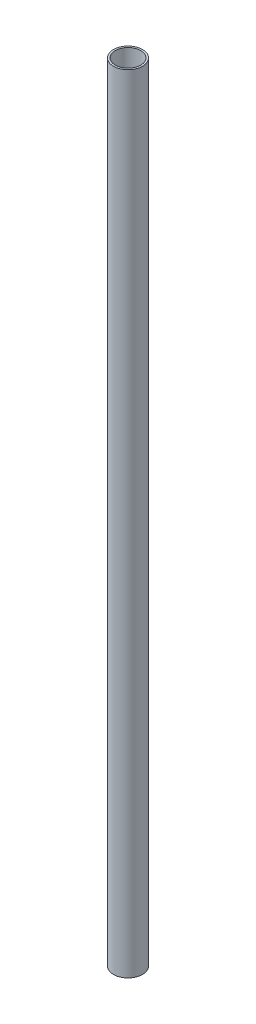
ISO-10303-21;
HEADER;
FILE_DESCRIPTION(('STEP AP214'),'2;1');
FILE_NAME('part.step','',(''),(''),'','','');
FILE_SCHEMA(('AUTOMOTIVE_DESIGN { 1 0 10303 214 1 1 1 1 }'));
ENDSEC;
DATA;
#1=APPLICATION_CONTEXT('core data for automotive mechanical design processes');
#2=APPLICATION_PROTOCOL_DEFINITION('international standard','automotive_design',2000,#1);
#3=PRODUCT_CONTEXT('',#1,'mechanical');
#4=PRODUCT('Part','Part','',(#3));
#5=PRODUCT_RELATED_PRODUCT_CATEGORY('part','',(#4));
#6=PRODUCT_DEFINITION_FORMATION('','',#4);
#7=PRODUCT_DEFINITION_CONTEXT('part definition',#1,'design');
#8=PRODUCT_DEFINITION('design','',#6,#7);
#9=PRODUCT_DEFINITION_SHAPE('','',#8);
#10=(LENGTH_UNIT() NAMED_UNIT(*) SI_UNIT(.MILLI.,.METRE.));
#11=(NAMED_UNIT(*) PLANE_ANGLE_UNIT() SI_UNIT($,.RADIAN.));
#12=(NAMED_UNIT(*) SI_UNIT($,.STERADIAN.) SOLID_ANGLE_UNIT());
#13=UNCERTAINTY_MEASURE_WITH_UNIT(LENGTH_MEASURE(1.E-05),#10,'distance_accuracy_value','');
#14=(GEOMETRIC_REPRESENTATION_CONTEXT(3) GLOBAL_UNCERTAINTY_ASSIGNED_CONTEXT((#13)) GLOBAL_UNIT_ASSIGNED_CONTEXT((#10,
#11,#12)) REPRESENTATION_CONTEXT('',''));
#15=CARTESIAN_POINT('',(0.,0.,0.));
#16=DIRECTION('',(0.,0.,1.));
#17=DIRECTION('',(1.,0.,0.));
#18=AXIS2_PLACEMENT_3D('',#15,#16,#17);
#19=CARTESIAN_POINT('',(0.,-5.32743783788669,0.));
#20=DIRECTION('',(0.,1.,0.));
#21=DIRECTION('',(0.,0.,1.));
#22=AXIS2_PLACEMENT_3D('',#19,#20,#21);
#23=PLANE('',#22);
#24=CARTESIAN_POINT('',(0.,-5.32743783788669,0.));
#25=DIRECTION('',(0.,1.,0.));
#26=DIRECTION('',(0.,0.,1.));
#27=AXIS2_PLACEMENT_3D('',#24,#25,#26);
#28=CIRCLE('',#27,9.52500000000004);
#29=CARTESIAN_POINT('',(0.,-5.32743783788669,9.52500000000004));
#30=VERTEX_POINT('',#29);
#31=EDGE_CURVE('E10',#30,#30,#28,.T.);
#32=ORIENTED_EDGE('',*,*,#31,.T.);
#33=EDGE_LOOP('',(#32));
#34=FACE_BOUND('',#33,.T.);
#35=CARTESIAN_POINT('',(0.,-5.32743783788669,0.));
#36=DIRECTION('',(0.,1.,0.));
#37=DIRECTION('',(0.,0.,1.));
#38=AXIS2_PLACEMENT_3D('',#35,#36,#37);
#39=CIRCLE('',#38,8.32500000000004);
#40=CARTESIAN_POINT('',(0.,-5.32743783788669,8.32500000000004));
#41=VERTEX_POINT('',#40);
#42=EDGE_CURVE('E49',#41,#41,#39,.T.);
#43=ORIENTED_EDGE('',*,*,#42,.F.);
#44=EDGE_LOOP('',(#43));
#45=FACE_BOUND('',#44,.T.);
#46=ADVANCED_FACE('F38',(#34,#45),#23,.T.);
#47=CARTESIAN_POINT('',(0.,-521.327437837887,0.));
#48=DIRECTION('',(0.,1.,0.));
#49=DIRECTION('',(0.,0.,1.));
#50=AXIS2_PLACEMENT_3D('',#47,#48,#49);
#51=PLANE('',#50);
#52=CARTESIAN_POINT('',(0.,-521.327437837887,0.));
#53=DIRECTION('',(0.,1.,0.));
#54=DIRECTION('',(0.,0.,1.));
#55=AXIS2_PLACEMENT_3D('',#52,#53,#54);
#56=CIRCLE('',#55,9.52500000000004);
#57=CARTESIAN_POINT('',(0.,-521.327437837887,9.52500000000004));
#58=VERTEX_POINT('',#57);
#59=EDGE_CURVE('E42',#58,#58,#56,.T.);
#60=ORIENTED_EDGE('',*,*,#59,.F.);
#61=EDGE_LOOP('',(#60));
#62=FACE_BOUND('',#61,.T.);
#63=CARTESIAN_POINT('',(0.,-521.327437837887,0.));
#64=DIRECTION('',(0.,1.,0.));
#65=DIRECTION('',(0.,0.,1.));
#66=AXIS2_PLACEMENT_3D('',#63,#64,#65);
#67=CIRCLE('',#66,8.32500000000004);
#68=CARTESIAN_POINT('',(0.,-521.327437837887,8.32500000000004));
#69=VERTEX_POINT('',#68);
#70=EDGE_CURVE('E51',#69,#69,#67,.T.);
#71=ORIENTED_EDGE('',*,*,#70,.T.);
#72=EDGE_LOOP('',(#71));
#73=FACE_BOUND('',#72,.T.);
#74=ADVANCED_FACE('F61',(#62,#73),#51,.F.);
#75=CARTESIAN_POINT('',(0.,-5.32743783788669,0.));
#76=DIRECTION('',(0.,-1.,0.));
#77=DIRECTION('',(0.,0.,-1.));
#78=AXIS2_PLACEMENT_3D('',#75,#76,#77);
#79=CYLINDRICAL_SURFACE('',#78,9.52500000000004);
#80=ORIENTED_EDGE('',*,*,#31,.F.);
#81=EDGE_LOOP('',(#80));
#82=FACE_BOUND('',#81,.T.);
#83=ORIENTED_EDGE('',*,*,#59,.T.);
#84=EDGE_LOOP('',(#83));
#85=FACE_BOUND('',#84,.T.);
#86=ADVANCED_FACE('F40',(#82,#85),#79,.T.);
#87=CARTESIAN_POINT('',(0.,-5.32743783788669,0.));
#88=DIRECTION('',(0.,-1.,0.));
#89=DIRECTION('',(0.,0.,-1.));
#90=AXIS2_PLACEMENT_3D('',#87,#88,#89);
#91=CYLINDRICAL_SURFACE('',#90,8.32500000000004);
#92=ORIENTED_EDGE('',*,*,#42,.T.);
#93=EDGE_LOOP('',(#92));
#94=FACE_BOUND('',#93,.T.);
#95=ORIENTED_EDGE('',*,*,#70,.F.);
#96=EDGE_LOOP('',(#95));
#97=FACE_BOUND('',#96,.T.);
#98=ADVANCED_FACE('F57',(#94,#97),#91,.F.);
#99=CLOSED_SHELL('',(#46,#74,#86,#98));
#100=MANIFOLD_SOLID_BREP('B2',#99);
#101=ADVANCED_BREP_SHAPE_REPRESENTATION('',(#18,#100),#14);
#102=SHAPE_DEFINITION_REPRESENTATION(#9,#101);
ENDSEC;
END-ISO-10303-21;
